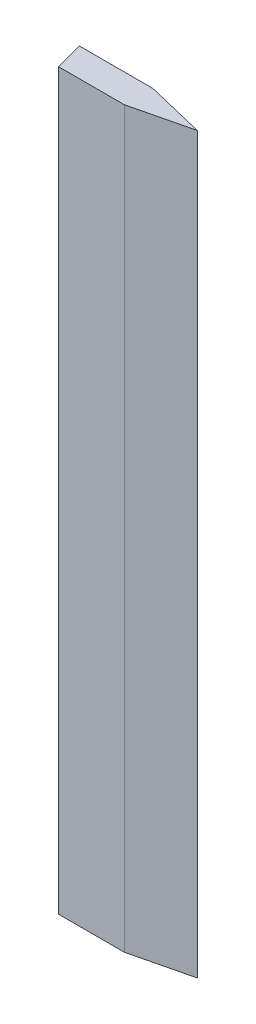
ISO-10303-21;
HEADER;
FILE_DESCRIPTION(('STEP AP214'),'2;1');
FILE_NAME('part.step','',(''),(''),'','','');
FILE_SCHEMA(('AUTOMOTIVE_DESIGN { 1 0 10303 214 1 1 1 1 }'));
ENDSEC;
DATA;
#1=APPLICATION_CONTEXT('core data for automotive mechanical design processes');
#2=APPLICATION_PROTOCOL_DEFINITION('international standard','automotive_design',2000,#1);
#3=PRODUCT_CONTEXT('',#1,'mechanical');
#4=PRODUCT('Part','Part','',(#3));
#5=PRODUCT_RELATED_PRODUCT_CATEGORY('part','',(#4));
#6=PRODUCT_DEFINITION_FORMATION('','',#4);
#7=PRODUCT_DEFINITION_CONTEXT('part definition',#1,'design');
#8=PRODUCT_DEFINITION('design','',#6,#7);
#9=PRODUCT_DEFINITION_SHAPE('','',#8);
#10=(LENGTH_UNIT() NAMED_UNIT(*) SI_UNIT(.MILLI.,.METRE.));
#11=(NAMED_UNIT(*) PLANE_ANGLE_UNIT() SI_UNIT($,.RADIAN.));
#12=(NAMED_UNIT(*) SI_UNIT($,.STERADIAN.) SOLID_ANGLE_UNIT());
#13=UNCERTAINTY_MEASURE_WITH_UNIT(LENGTH_MEASURE(1.E-05),#10,'distance_accuracy_value','');
#14=(GEOMETRIC_REPRESENTATION_CONTEXT(3) GLOBAL_UNCERTAINTY_ASSIGNED_CONTEXT((#13)) GLOBAL_UNIT_ASSIGNED_CONTEXT((#10,
#11,#12)) REPRESENTATION_CONTEXT('',''));
#15=CARTESIAN_POINT('',(0.,0.,0.));
#16=DIRECTION('',(0.,0.,1.));
#17=DIRECTION('',(1.,0.,0.));
#18=AXIS2_PLACEMENT_3D('',#15,#16,#17);
#19=CARTESIAN_POINT('',(0.657450856516683,63.5,2.45364));
#20=DIRECTION('',(0.96592582628907,0.,-0.258819045102515));
#21=DIRECTION('',(-0.258819045102515,0.,-0.96592582628907));
#22=AXIS2_PLACEMENT_3D('',#19,#20,#21);
#23=PLANE('',#22);
#24=DIRECTION('',(0.258819045102515,0.,0.96592582628907));
#25=VECTOR('',#24,1.);
#26=CARTESIAN_POINT('',(0.657450856516683,0.,2.45364));
#27=LINE('',#26,#25);
#28=CARTESIAN_POINT('',(0.,0.,0.));
#29=VERTEX_POINT('',#28);
#30=CARTESIAN_POINT('',(0.657450856516683,0.,2.45364));
#31=VERTEX_POINT('',#30);
#32=EDGE_CURVE('E118',#29,#31,#27,.T.);
#33=ORIENTED_EDGE('',*,*,#32,.T.);
#34=DIRECTION('',(0.,-1.,0.));
#35=VECTOR('',#34,1.);
#36=CARTESIAN_POINT('',(0.657450856516683,63.5,2.45364));
#37=LINE('',#36,#35);
#38=CARTESIAN_POINT('',(0.657450856516683,63.5,2.45364));
#39=VERTEX_POINT('',#38);
#40=EDGE_CURVE('E11',#39,#31,#37,.T.);
#41=ORIENTED_EDGE('',*,*,#40,.F.);
#42=DIRECTION('',(0.258819045102515,0.,0.96592582628907));
#43=VECTOR('',#42,1.);
#44=CARTESIAN_POINT('',(0.657450856516683,63.5,2.45364));
#45=LINE('',#44,#43);
#46=CARTESIAN_POINT('',(0.,63.5,0.));
#47=VERTEX_POINT('',#46);
#48=EDGE_CURVE('E131',#47,#39,#45,.T.);
#49=ORIENTED_EDGE('',*,*,#48,.F.);
#50=DIRECTION('',(0.,-1.,0.));
#51=VECTOR('',#50,1.);
#52=CARTESIAN_POINT('',(0.,63.5,0.));
#53=LINE('',#52,#51);
#54=EDGE_CURVE('E114',#47,#29,#53,.T.);
#55=ORIENTED_EDGE('',*,*,#54,.T.);
#56=EDGE_LOOP('',(#33,#41,#49,#55));
#57=FACE_BOUND('',#56,.T.);
#58=ADVANCED_FACE('F39',(#57),#23,.F.);
#59=CARTESIAN_POINT('',(6.35,63.5,2.45364));
#60=DIRECTION('',(0.,0.,-1.));
#61=DIRECTION('',(-1.,0.,0.));
#62=AXIS2_PLACEMENT_3D('',#59,#60,#61);
#63=PLANE('',#62);
#64=DIRECTION('',(1.,0.,0.));
#65=VECTOR('',#64,1.);
#66=CARTESIAN_POINT('',(6.35,0.,2.45364));
#67=LINE('',#66,#65);
#68=CARTESIAN_POINT('',(6.35,0.,2.45364));
#69=VERTEX_POINT('',#68);
#70=EDGE_CURVE('E122',#31,#69,#67,.T.);
#71=ORIENTED_EDGE('',*,*,#70,.T.);
#72=DIRECTION('',(0.,-1.,0.));
#73=VECTOR('',#72,1.);
#74=CARTESIAN_POINT('',(6.35,63.5,2.45364));
#75=LINE('',#74,#73);
#76=CARTESIAN_POINT('',(6.35,63.5,2.45364));
#77=VERTEX_POINT('',#76);
#78=EDGE_CURVE('E48',#77,#69,#75,.T.);
#79=ORIENTED_EDGE('',*,*,#78,.F.);
#80=DIRECTION('',(1.,0.,0.));
#81=VECTOR('',#80,1.);
#82=CARTESIAN_POINT('',(6.35,63.5,2.45364));
#83=LINE('',#82,#81);
#84=EDGE_CURVE('E90',#39,#77,#83,.T.);
#85=ORIENTED_EDGE('',*,*,#84,.F.);
#86=ORIENTED_EDGE('',*,*,#40,.T.);
#87=EDGE_LOOP('',(#71,#79,#85,#86));
#88=FACE_BOUND('',#87,.T.);
#89=ADVANCED_FACE('F153',(#88),#63,.F.);
#90=CARTESIAN_POINT('',(11.43,63.5,1.22682));
#91=DIRECTION('',(-0.23475138958652,0.,-0.972055443422441));
#92=DIRECTION('',(-0.972055443422441,0.,0.23475138958652));
#93=AXIS2_PLACEMENT_3D('',#90,#91,#92);
#94=PLANE('',#93);
#95=DIRECTION('',(0.972055443422441,0.,-0.23475138958652));
#96=VECTOR('',#95,1.);
#97=CARTESIAN_POINT('',(11.43,0.,1.22682));
#98=LINE('',#97,#96);
#99=CARTESIAN_POINT('',(11.43,0.,1.22682));
#100=VERTEX_POINT('',#99);
#101=EDGE_CURVE('E106',#69,#100,#98,.T.);
#102=ORIENTED_EDGE('',*,*,#101,.T.);
#103=DIRECTION('',(0.,-1.,0.));
#104=VECTOR('',#103,1.);
#105=CARTESIAN_POINT('',(11.43,63.5,1.22682));
#106=LINE('',#105,#104);
#107=CARTESIAN_POINT('',(11.43,63.5,1.22682));
#108=VERTEX_POINT('',#107);
#109=EDGE_CURVE('E103',#108,#100,#106,.T.);
#110=ORIENTED_EDGE('',*,*,#109,.F.);
#111=DIRECTION('',(0.972055443422441,0.,-0.23475138958652));
#112=VECTOR('',#111,1.);
#113=CARTESIAN_POINT('',(11.43,63.5,1.22682));
#114=LINE('',#113,#112);
#115=EDGE_CURVE('E94',#77,#108,#114,.T.);
#116=ORIENTED_EDGE('',*,*,#115,.F.);
#117=ORIENTED_EDGE('',*,*,#78,.T.);
#118=EDGE_LOOP('',(#102,#110,#116,#117));
#119=FACE_BOUND('',#118,.T.);
#120=ADVANCED_FACE('F104',(#119),#94,.F.);
#121=CARTESIAN_POINT('',(6.35,63.5,0.));
#122=DIRECTION('',(-0.234751389586519,0.,0.972055443422441));
#123=DIRECTION('',(0.972055443422441,0.,0.234751389586519));
#124=AXIS2_PLACEMENT_3D('',#121,#122,#123);
#125=PLANE('',#124);
#126=DIRECTION('',(-0.972055443422441,0.,-0.234751389586519));
#127=VECTOR('',#126,1.);
#128=CARTESIAN_POINT('',(6.35,0.,0.));
#129=LINE('',#128,#127);
#130=CARTESIAN_POINT('',(6.35,0.,0.));
#131=VERTEX_POINT('',#130);
#132=EDGE_CURVE('E76',#100,#131,#129,.T.);
#133=ORIENTED_EDGE('',*,*,#132,.T.);
#134=DIRECTION('',(0.,-1.,0.));
#135=VECTOR('',#134,1.);
#136=CARTESIAN_POINT('',(6.35,63.5,0.));
#137=LINE('',#136,#135);
#138=CARTESIAN_POINT('',(6.35,63.5,0.));
#139=VERTEX_POINT('',#138);
#140=EDGE_CURVE('E108',#139,#131,#137,.T.);
#141=ORIENTED_EDGE('',*,*,#140,.F.);
#142=DIRECTION('',(-0.972055443422441,0.,-0.234751389586519));
#143=VECTOR('',#142,1.);
#144=CARTESIAN_POINT('',(6.35,63.5,0.));
#145=LINE('',#144,#143);
#146=EDGE_CURVE('E98',#108,#139,#145,.T.);
#147=ORIENTED_EDGE('',*,*,#146,.F.);
#148=ORIENTED_EDGE('',*,*,#109,.T.);
#149=EDGE_LOOP('',(#133,#141,#147,#148));
#150=FACE_BOUND('',#149,.T.);
#151=ADVANCED_FACE('F110',(#150),#125,.F.);
#152=CARTESIAN_POINT('',(0.,63.5,0.));
#153=DIRECTION('',(0.,0.,1.));
#154=DIRECTION('',(1.,0.,0.));
#155=AXIS2_PLACEMENT_3D('',#152,#153,#154);
#156=PLANE('',#155);
#157=DIRECTION('',(-1.,0.,0.));
#158=VECTOR('',#157,1.);
#159=CARTESIAN_POINT('',(0.,0.,0.));
#160=LINE('',#159,#158);
#161=EDGE_CURVE('E82',#131,#29,#160,.T.);
#162=ORIENTED_EDGE('',*,*,#161,.T.);
#163=ORIENTED_EDGE('',*,*,#54,.F.);
#164=DIRECTION('',(-1.,0.,0.));
#165=VECTOR('',#164,1.);
#166=CARTESIAN_POINT('',(0.,63.5,0.));
#167=LINE('',#166,#165);
#168=EDGE_CURVE('E56',#139,#47,#167,.T.);
#169=ORIENTED_EDGE('',*,*,#168,.F.);
#170=ORIENTED_EDGE('',*,*,#140,.T.);
#171=EDGE_LOOP('',(#162,#163,#169,#170));
#172=FACE_BOUND('',#171,.T.);
#173=ADVANCED_FACE('F142',(#172),#156,.F.);
#174=CARTESIAN_POINT('',(0.,63.5,0.));
#175=DIRECTION('',(0.,1.,0.));
#176=DIRECTION('',(0.,0.,1.));
#177=AXIS2_PLACEMENT_3D('',#174,#175,#176);
#178=PLANE('',#177);
#179=ORIENTED_EDGE('',*,*,#48,.T.);
#180=ORIENTED_EDGE('',*,*,#84,.T.);
#181=ORIENTED_EDGE('',*,*,#115,.T.);
#182=ORIENTED_EDGE('',*,*,#146,.T.);
#183=ORIENTED_EDGE('',*,*,#168,.T.);
#184=EDGE_LOOP('',(#179,#180,#181,#182,#183));
#185=FACE_BOUND('',#184,.T.);
#186=ADVANCED_FACE('F96',(#185),#178,.T.);
#187=CARTESIAN_POINT('',(0.,0.,0.));
#188=DIRECTION('',(0.,1.,0.));
#189=DIRECTION('',(0.,0.,1.));
#190=AXIS2_PLACEMENT_3D('',#187,#188,#189);
#191=PLANE('',#190);
#192=ORIENTED_EDGE('',*,*,#32,.F.);
#193=ORIENTED_EDGE('',*,*,#161,.F.);
#194=ORIENTED_EDGE('',*,*,#132,.F.);
#195=ORIENTED_EDGE('',*,*,#101,.F.);
#196=ORIENTED_EDGE('',*,*,#70,.F.);
#197=EDGE_LOOP('',(#192,#193,#194,#195,#196));
#198=FACE_BOUND('',#197,.T.);
#199=ADVANCED_FACE('F138',(#198),#191,.F.);
#200=CLOSED_SHELL('',(#58,#89,#120,#151,#173,#186,#199));
#201=MANIFOLD_SOLID_BREP('B2',#200);
#202=ADVANCED_BREP_SHAPE_REPRESENTATION('',(#18,#201),#14);
#203=SHAPE_DEFINITION_REPRESENTATION(#9,#202);
ENDSEC;
END-ISO-10303-21;
